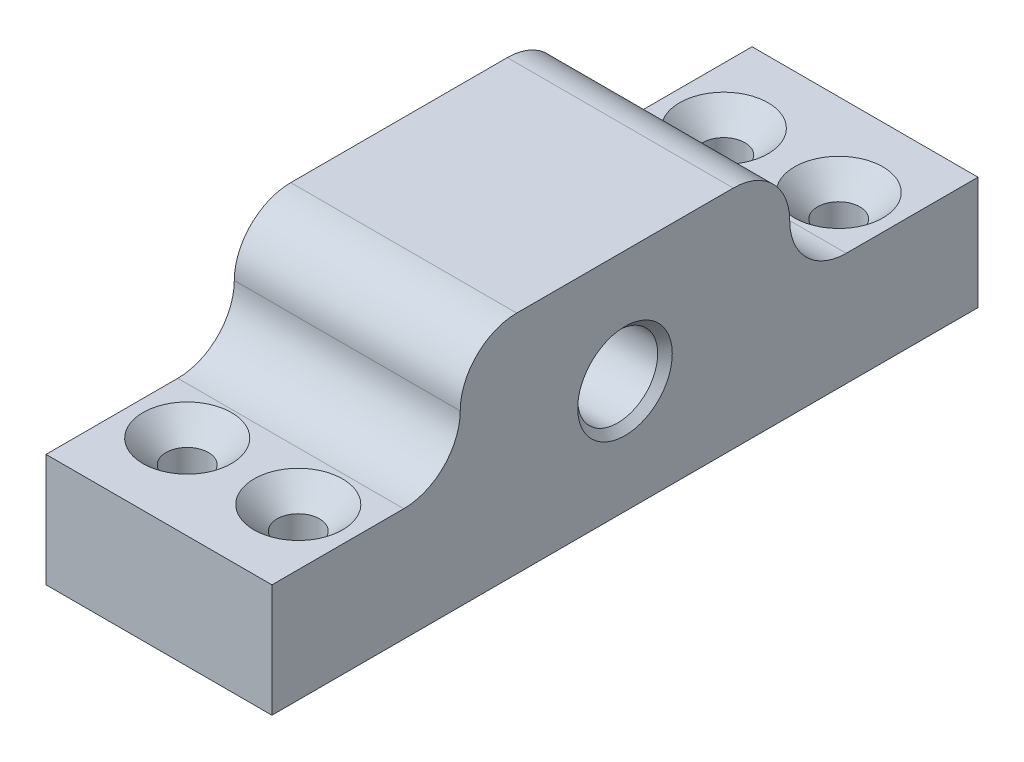
ISO-10303-21;
HEADER;
FILE_DESCRIPTION(('STEP AP214'),'2;1');
FILE_NAME('part.step','',(''),(''),'','','');
FILE_SCHEMA(('AUTOMOTIVE_DESIGN { 1 0 10303 214 1 1 1 1 }'));
ENDSEC;
DATA;
#1=APPLICATION_CONTEXT('core data for automotive mechanical design processes');
#2=APPLICATION_PROTOCOL_DEFINITION('international standard','automotive_design',2000,#1);
#3=PRODUCT_CONTEXT('',#1,'mechanical');
#4=PRODUCT('Part','Part','',(#3));
#5=PRODUCT_RELATED_PRODUCT_CATEGORY('part','',(#4));
#6=PRODUCT_DEFINITION_FORMATION('','',#4);
#7=PRODUCT_DEFINITION_CONTEXT('part definition',#1,'design');
#8=PRODUCT_DEFINITION('design','',#6,#7);
#9=PRODUCT_DEFINITION_SHAPE('','',#8);
#10=(LENGTH_UNIT() NAMED_UNIT(*) SI_UNIT(.MILLI.,.METRE.));
#11=(NAMED_UNIT(*) PLANE_ANGLE_UNIT() SI_UNIT($,.RADIAN.));
#12=(NAMED_UNIT(*) SI_UNIT($,.STERADIAN.) SOLID_ANGLE_UNIT());
#13=UNCERTAINTY_MEASURE_WITH_UNIT(LENGTH_MEASURE(1.E-05),#10,'distance_accuracy_value','');
#14=(GEOMETRIC_REPRESENTATION_CONTEXT(3) GLOBAL_UNCERTAINTY_ASSIGNED_CONTEXT((#13)) GLOBAL_UNIT_ASSIGNED_CONTEXT((#10,
#11,#12)) REPRESENTATION_CONTEXT('',''));
#15=CARTESIAN_POINT('',(0.,0.,0.));
#16=DIRECTION('',(0.,0.,1.));
#17=DIRECTION('',(1.,0.,0.));
#18=AXIS2_PLACEMENT_3D('',#15,#16,#17);
#19=CARTESIAN_POINT('',(24.,11.9999999999999,-37.4999999999996));
#20=DIRECTION('',(0.,0.,1.));
#21=DIRECTION('',(1.,0.,0.));
#22=AXIS2_PLACEMENT_3D('',#19,#20,#21);
#23=PLANE('',#22);
#24=DIRECTION('',(1.,0.,0.));
#25=VECTOR('',#24,1.);
#26=CARTESIAN_POINT('',(0.,-1.40512601554121E-13,-37.5000000000001));
#27=LINE('',#26,#25);
#28=CARTESIAN_POINT('',(0.,-1.40512601554121E-13,-37.5000000000001));
#29=VERTEX_POINT('',#28);
#30=CARTESIAN_POINT('',(24.,-1.40512601554121E-13,-37.5000000000001));
#31=VERTEX_POINT('',#30);
#32=EDGE_CURVE('E122',#29,#31,#27,.T.);
#33=ORIENTED_EDGE('',*,*,#32,.T.);
#34=DIRECTION('',(0.,1.,0.));
#35=VECTOR('',#34,1.);
#36=CARTESIAN_POINT('',(24.,11.9999999999999,-37.4999999999996));
#37=LINE('',#36,#35);
#38=CARTESIAN_POINT('',(24.,-12.0000000000001,-37.4999999999996));
#39=VERTEX_POINT('',#38);
#40=EDGE_CURVE('E226',#39,#31,#37,.T.);
#41=ORIENTED_EDGE('',*,*,#40,.F.);
#42=DIRECTION('',(-1.,0.,0.));
#43=VECTOR('',#42,1.);
#44=CARTESIAN_POINT('',(24.,-12.0000000000001,-37.4999999999996));
#45=LINE('',#44,#43);
#46=CARTESIAN_POINT('',(0.,-12.0000000000001,-37.4999999999996));
#47=VERTEX_POINT('',#46);
#48=EDGE_CURVE('E141',#39,#47,#45,.T.);
#49=ORIENTED_EDGE('',*,*,#48,.T.);
#50=DIRECTION('',(0.,1.,0.));
#51=VECTOR('',#50,1.);
#52=CARTESIAN_POINT('',(0.,11.9999999999999,-37.4999999999996));
#53=LINE('',#52,#51);
#54=EDGE_CURVE('E137',#47,#29,#53,.T.);
#55=ORIENTED_EDGE('',*,*,#54,.T.);
#56=EDGE_LOOP('',(#33,#41,#49,#55));
#57=FACE_BOUND('',#56,.T.);
#58=ADVANCED_FACE('F48',(#57),#23,.F.);
#59=CARTESIAN_POINT('',(24.,11.9999999999999,-37.4999999999996));
#60=DIRECTION('',(0.,-1.,0.));
#61=DIRECTION('',(0.,0.,-1.));
#62=AXIS2_PLACEMENT_3D('',#59,#60,#61);
#63=PLANE('',#62);
#64=DIRECTION('',(0.,0.,1.));
#65=VECTOR('',#64,1.);
#66=CARTESIAN_POINT('',(24.,11.9999999999999,-37.4999999999996));
#67=LINE('',#66,#65);
#68=CARTESIAN_POINT('',(24.,11.9999999999999,-11.5000000000001));
#69=VERTEX_POINT('',#68);
#70=CARTESIAN_POINT('',(24.,11.9999999999999,11.5000000000001));
#71=VERTEX_POINT('',#70);
#72=EDGE_CURVE('E153',#69,#71,#67,.T.);
#73=ORIENTED_EDGE('',*,*,#72,.F.);
#74=DIRECTION('',(1.,0.,0.));
#75=VECTOR('',#74,1.);
#76=CARTESIAN_POINT('',(0.,11.9999999999999,-11.5000000000001));
#77=LINE('',#76,#75);
#78=CARTESIAN_POINT('',(0.,11.9999999999999,-11.5000000000001));
#79=VERTEX_POINT('',#78);
#80=EDGE_CURVE('E177',#69,#79,#77,.F.);
#81=ORIENTED_EDGE('',*,*,#80,.T.);
#82=DIRECTION('',(0.,0.,1.));
#83=VECTOR('',#82,1.);
#84=CARTESIAN_POINT('',(0.,11.9999999999999,-37.4999999999996));
#85=LINE('',#84,#83);
#86=CARTESIAN_POINT('',(0.,11.9999999999999,11.5000000000001));
#87=VERTEX_POINT('',#86);
#88=EDGE_CURVE('E142',#79,#87,#85,.T.);
#89=ORIENTED_EDGE('',*,*,#88,.T.);
#90=DIRECTION('',(1.,0.,0.));
#91=VECTOR('',#90,1.);
#92=CARTESIAN_POINT('',(24.,11.9999999999999,11.5000000000001));
#93=LINE('',#92,#91);
#94=EDGE_CURVE('E156',#87,#71,#93,.T.);
#95=ORIENTED_EDGE('',*,*,#94,.T.);
#96=EDGE_LOOP('',(#73,#81,#89,#95));
#97=FACE_BOUND('',#96,.T.);
#98=ADVANCED_FACE('F196',(#97),#63,.F.);
#99=CARTESIAN_POINT('',(24.,0.,0.));
#100=DIRECTION('',(-1.,0.,0.));
#101=DIRECTION('',(0.,0.,1.));
#102=AXIS2_PLACEMENT_3D('',#99,#100,#101);
#103=PLANE('',#102);
#104=CARTESIAN_POINT('',(24.,0.,0.));
#105=DIRECTION('',(1.,0.,0.));
#106=DIRECTION('',(0.,0.,-1.));
#107=AXIS2_PLACEMENT_3D('',#104,#105,#106);
#108=CIRCLE('',#107,5.025);
#109=CARTESIAN_POINT('',(24.,0.,-5.025));
#110=VERTEX_POINT('',#109);
#111=EDGE_CURVE('E310',#110,#110,#108,.T.);
#112=ORIENTED_EDGE('',*,*,#111,.F.);
#113=EDGE_LOOP('',(#112));
#114=FACE_BOUND('',#113,.T.);
#115=DIRECTION('',(0.,0.,1.));
#116=VECTOR('',#115,1.);
#117=CARTESIAN_POINT('',(24.,-1.40512601554121E-13,-37.5000000000001));
#118=LINE('',#117,#116);
#119=CARTESIAN_POINT('',(24.,0.,-23.5));
#120=VERTEX_POINT('',#119);
#121=EDGE_CURVE('E127',#31,#120,#118,.T.);
#122=ORIENTED_EDGE('',*,*,#121,.T.);
#123=CARTESIAN_POINT('',(24.,5.99999999999996,-23.5000000000001));
#124=DIRECTION('',(-1.,0.,0.));
#125=DIRECTION('',(0.,0.,1.));
#126=AXIS2_PLACEMENT_3D('',#123,#124,#125);
#127=CIRCLE('',#126,6.);
#128=CARTESIAN_POINT('',(24.,5.99999999999987,-17.5000000000001));
#129=VERTEX_POINT('',#128);
#130=EDGE_CURVE('E57',#120,#129,#127,.T.);
#131=ORIENTED_EDGE('',*,*,#130,.T.);
#132=CARTESIAN_POINT('',(24.,5.99999999999987,-11.5000000000001));
#133=DIRECTION('',(-1.,0.,0.));
#134=DIRECTION('',(0.,0.,1.));
#135=AXIS2_PLACEMENT_3D('',#132,#133,#134);
#136=CIRCLE('',#135,6.);
#137=EDGE_CURVE('E170',#129,#69,#136,.F.);
#138=ORIENTED_EDGE('',*,*,#137,.T.);
#139=ORIENTED_EDGE('',*,*,#72,.T.);
#140=CARTESIAN_POINT('',(24.,5.99999999999986,11.5000000000001));
#141=DIRECTION('',(-1.,0.,0.));
#142=DIRECTION('',(0.,0.,1.));
#143=AXIS2_PLACEMENT_3D('',#140,#141,#142);
#144=CIRCLE('',#143,6.);
#145=CARTESIAN_POINT('',(24.,5.99999999999986,17.5000000000001));
#146=VERTEX_POINT('',#145);
#147=EDGE_CURVE('E159',#71,#146,#144,.F.);
#148=ORIENTED_EDGE('',*,*,#147,.T.);
#149=CARTESIAN_POINT('',(24.,5.99999999999996,23.5000000000001));
#150=DIRECTION('',(-1.,0.,0.));
#151=DIRECTION('',(0.,0.,1.));
#152=AXIS2_PLACEMENT_3D('',#149,#150,#151);
#153=CIRCLE('',#152,6.);
#154=CARTESIAN_POINT('',(24.,0.,23.5));
#155=VERTEX_POINT('',#154);
#156=EDGE_CURVE('E166',#146,#155,#153,.T.);
#157=ORIENTED_EDGE('',*,*,#156,.T.);
#158=DIRECTION('',(0.,0.,-1.));
#159=VECTOR('',#158,1.);
#160=CARTESIAN_POINT('',(24.,-1.40512601554121E-13,37.5000000000001));
#161=LINE('',#160,#159);
#162=CARTESIAN_POINT('',(24.,-1.40512601554121E-13,37.5000000000001));
#163=VERTEX_POINT('',#162);
#164=EDGE_CURVE('E174',#163,#155,#161,.T.);
#165=ORIENTED_EDGE('',*,*,#164,.F.);
#166=DIRECTION('',(0.,-1.,0.));
#167=VECTOR('',#166,1.);
#168=CARTESIAN_POINT('',(24.,11.9999999999999,37.5000000000001));
#169=LINE('',#168,#167);
#170=CARTESIAN_POINT('',(24.,-12.0000000000001,37.5000000000001));
#171=VERTEX_POINT('',#170);
#172=EDGE_CURVE('E145',#163,#171,#169,.T.);
#173=ORIENTED_EDGE('',*,*,#172,.T.);
#174=DIRECTION('',(0.,0.,-1.));
#175=VECTOR('',#174,1.);
#176=CARTESIAN_POINT('',(24.,-12.0000000000001,-37.4999999999996));
#177=LINE('',#176,#175);
#178=EDGE_CURVE('E224',#171,#39,#177,.T.);
#179=ORIENTED_EDGE('',*,*,#178,.T.);
#180=ORIENTED_EDGE('',*,*,#40,.T.);
#181=EDGE_LOOP('',(#122,#131,#138,#139,#148,#157,#165,#173,#179,#180));
#182=FACE_BOUND('',#181,.T.);
#183=ADVANCED_FACE('F186',(#114,#182),#103,.F.);
#184=CARTESIAN_POINT('',(0.,0.,0.));
#185=DIRECTION('',(-1.,0.,0.));
#186=DIRECTION('',(0.,0.,1.));
#187=AXIS2_PLACEMENT_3D('',#184,#185,#186);
#188=PLANE('',#187);
#189=CARTESIAN_POINT('',(0.,0.,0.));
#190=DIRECTION('',(1.,0.,0.));
#191=DIRECTION('',(0.,0.,-1.));
#192=AXIS2_PLACEMENT_3D('',#189,#190,#191);
#193=CIRCLE('',#192,4.24999999999999);
#194=CARTESIAN_POINT('',(0.,0.,-4.24999999999999));
#195=VERTEX_POINT('',#194);
#196=EDGE_CURVE('E312',#195,#195,#193,.T.);
#197=ORIENTED_EDGE('',*,*,#196,.T.);
#198=EDGE_LOOP('',(#197));
#199=FACE_BOUND('',#198,.T.);
#200=ORIENTED_EDGE('',*,*,#88,.F.);
#201=CARTESIAN_POINT('',(0.,5.99999999999987,-11.5000000000001));
#202=DIRECTION('',(-1.,0.,0.));
#203=DIRECTION('',(0.,0.,1.));
#204=AXIS2_PLACEMENT_3D('',#201,#202,#203);
#205=CIRCLE('',#204,6.);
#206=CARTESIAN_POINT('',(0.,5.99999999999987,-17.5000000000001));
#207=VERTEX_POINT('',#206);
#208=EDGE_CURVE('E67',#79,#207,#205,.T.);
#209=ORIENTED_EDGE('',*,*,#208,.T.);
#210=CARTESIAN_POINT('',(0.,5.99999999999996,-23.5000000000001));
#211=DIRECTION('',(-1.,0.,0.));
#212=DIRECTION('',(0.,0.,1.));
#213=AXIS2_PLACEMENT_3D('',#210,#211,#212);
#214=CIRCLE('',#213,6.);
#215=CARTESIAN_POINT('',(0.,0.,-23.5));
#216=VERTEX_POINT('',#215);
#217=EDGE_CURVE('E13',#207,#216,#214,.F.);
#218=ORIENTED_EDGE('',*,*,#217,.T.);
#219=DIRECTION('',(0.,0.,1.));
#220=VECTOR('',#219,1.);
#221=CARTESIAN_POINT('',(0.,-1.40512601554121E-13,-37.5000000000001));
#222=LINE('',#221,#220);
#223=EDGE_CURVE('E124',#29,#216,#222,.T.);
#224=ORIENTED_EDGE('',*,*,#223,.F.);
#225=ORIENTED_EDGE('',*,*,#54,.F.);
#226=DIRECTION('',(0.,0.,-1.));
#227=VECTOR('',#226,1.);
#228=CARTESIAN_POINT('',(0.,-12.0000000000001,-37.4999999999996));
#229=LINE('',#228,#227);
#230=CARTESIAN_POINT('',(0.,-12.0000000000001,37.5000000000001));
#231=VERTEX_POINT('',#230);
#232=EDGE_CURVE('E143',#231,#47,#229,.T.);
#233=ORIENTED_EDGE('',*,*,#232,.F.);
#234=DIRECTION('',(0.,-1.,0.));
#235=VECTOR('',#234,1.);
#236=CARTESIAN_POINT('',(0.,11.9999999999999,37.5000000000001));
#237=LINE('',#236,#235);
#238=CARTESIAN_POINT('',(0.,-1.40512601554121E-13,37.5000000000001));
#239=VERTEX_POINT('',#238);
#240=EDGE_CURVE('E147',#239,#231,#237,.T.);
#241=ORIENTED_EDGE('',*,*,#240,.F.);
#242=DIRECTION('',(0.,0.,-1.));
#243=VECTOR('',#242,1.);
#244=CARTESIAN_POINT('',(0.,-1.40512601554121E-13,37.5000000000001));
#245=LINE('',#244,#243);
#246=CARTESIAN_POINT('',(0.,0.,23.5));
#247=VERTEX_POINT('',#246);
#248=EDGE_CURVE('E213',#239,#247,#245,.T.);
#249=ORIENTED_EDGE('',*,*,#248,.T.);
#250=CARTESIAN_POINT('',(0.,5.99999999999996,23.5000000000001));
#251=DIRECTION('',(-1.,0.,0.));
#252=DIRECTION('',(0.,0.,1.));
#253=AXIS2_PLACEMENT_3D('',#250,#251,#252);
#254=CIRCLE('',#253,6.);
#255=CARTESIAN_POINT('',(0.,5.99999999999986,17.5000000000001));
#256=VERTEX_POINT('',#255);
#257=EDGE_CURVE('E168',#247,#256,#254,.F.);
#258=ORIENTED_EDGE('',*,*,#257,.T.);
#259=CARTESIAN_POINT('',(0.,5.99999999999986,11.5000000000001));
#260=DIRECTION('',(-1.,0.,0.));
#261=DIRECTION('',(0.,0.,1.));
#262=AXIS2_PLACEMENT_3D('',#259,#260,#261);
#263=CIRCLE('',#262,6.);
#264=EDGE_CURVE('E161',#256,#87,#263,.T.);
#265=ORIENTED_EDGE('',*,*,#264,.T.);
#266=EDGE_LOOP('',(#200,#209,#218,#224,#225,#233,#241,#249,#258,#265));
#267=FACE_BOUND('',#266,.T.);
#268=ADVANCED_FACE('F135',(#199,#267),#188,.T.);
#269=CARTESIAN_POINT('',(24.,11.9999999999999,37.5000000000001));
#270=DIRECTION('',(0.,0.,-1.));
#271=DIRECTION('',(-1.,0.,0.));
#272=AXIS2_PLACEMENT_3D('',#269,#270,#271);
#273=PLANE('',#272);
#274=ORIENTED_EDGE('',*,*,#172,.F.);
#275=DIRECTION('',(1.,0.,0.));
#276=VECTOR('',#275,1.);
#277=CARTESIAN_POINT('',(0.,-1.40512601554121E-13,37.5000000000001));
#278=LINE('',#277,#276);
#279=EDGE_CURVE('E216',#239,#163,#278,.T.);
#280=ORIENTED_EDGE('',*,*,#279,.F.);
#281=ORIENTED_EDGE('',*,*,#240,.T.);
#282=DIRECTION('',(-1.,0.,0.));
#283=VECTOR('',#282,1.);
#284=CARTESIAN_POINT('',(24.,-12.0000000000001,37.5000000000001));
#285=LINE('',#284,#283);
#286=EDGE_CURVE('E152',#171,#231,#285,.T.);
#287=ORIENTED_EDGE('',*,*,#286,.F.);
#288=EDGE_LOOP('',(#274,#280,#281,#287));
#289=FACE_BOUND('',#288,.T.);
#290=ADVANCED_FACE('F231',(#289),#273,.F.);
#291=CARTESIAN_POINT('',(24.,-12.0000000000001,-37.4999999999996));
#292=DIRECTION('',(0.,1.,0.));
#293=DIRECTION('',(0.,0.,1.));
#294=AXIS2_PLACEMENT_3D('',#291,#292,#293);
#295=PLANE('',#294);
#296=CARTESIAN_POINT('',(6.,-12.0000000000006,-28.5));
#297=DIRECTION('',(0.,1.,0.));
#298=DIRECTION('',(0.,0.,1.));
#299=AXIS2_PLACEMENT_3D('',#296,#297,#298);
#300=CIRCLE('',#299,2.25);
#301=CARTESIAN_POINT('',(6.,-12.0000000000006,-26.25));
#302=VERTEX_POINT('',#301);
#303=EDGE_CURVE('E323',#302,#302,#300,.T.);
#304=ORIENTED_EDGE('',*,*,#303,.T.);
#305=EDGE_LOOP('',(#304));
#306=FACE_BOUND('',#305,.T.);
#307=CARTESIAN_POINT('',(18.,-12.0000000000006,-28.7024893433951));
#308=DIRECTION('',(0.,1.,0.));
#309=DIRECTION('',(0.,0.,1.));
#310=AXIS2_PLACEMENT_3D('',#307,#308,#309);
#311=CIRCLE('',#310,2.25);
#312=CARTESIAN_POINT('',(18.,-12.0000000000006,-26.4524893433951));
#313=VERTEX_POINT('',#312);
#314=EDGE_CURVE('E192',#313,#313,#311,.T.);
#315=ORIENTED_EDGE('',*,*,#314,.T.);
#316=EDGE_LOOP('',(#315));
#317=FACE_BOUND('',#316,.T.);
#318=CARTESIAN_POINT('',(6.,-12.0000000000006,28.5));
#319=DIRECTION('',(0.,1.,0.));
#320=DIRECTION('',(0.,0.,1.));
#321=AXIS2_PLACEMENT_3D('',#318,#319,#320);
#322=CIRCLE('',#321,2.25);
#323=CARTESIAN_POINT('',(6.,-12.0000000000006,30.75));
#324=VERTEX_POINT('',#323);
#325=EDGE_CURVE('E339',#324,#324,#322,.T.);
#326=ORIENTED_EDGE('',*,*,#325,.T.);
#327=EDGE_LOOP('',(#326));
#328=FACE_BOUND('',#327,.T.);
#329=CARTESIAN_POINT('',(18.,-12.0000000000006,28.7024893433951));
#330=DIRECTION('',(0.,1.,0.));
#331=DIRECTION('',(0.,0.,1.));
#332=AXIS2_PLACEMENT_3D('',#329,#330,#331);
#333=CIRCLE('',#332,2.25);
#334=CARTESIAN_POINT('',(18.,-12.0000000000006,30.9524893433951));
#335=VERTEX_POINT('',#334);
#336=EDGE_CURVE('E175',#335,#335,#333,.T.);
#337=ORIENTED_EDGE('',*,*,#336,.T.);
#338=EDGE_LOOP('',(#337));
#339=FACE_BOUND('',#338,.T.);
#340=ORIENTED_EDGE('',*,*,#232,.T.);
#341=ORIENTED_EDGE('',*,*,#48,.F.);
#342=ORIENTED_EDGE('',*,*,#178,.F.);
#343=ORIENTED_EDGE('',*,*,#286,.T.);
#344=EDGE_LOOP('',(#340,#341,#342,#343));
#345=FACE_BOUND('',#344,.T.);
#346=ADVANCED_FACE('F234',(#306,#317,#328,#339,#345),#295,.F.);
#347=CARTESIAN_POINT('',(0.,-1.40512601554121E-13,37.5000000000001));
#348=DIRECTION('',(0.,-1.,0.));
#349=DIRECTION('',(0.,0.,-1.));
#350=AXIS2_PLACEMENT_3D('',#347,#348,#349);
#351=PLANE('',#350);
#352=CARTESIAN_POINT('',(6.,-2.00230457214624E-13,28.5000000000001));
#353=DIRECTION('',(0.,1.,0.));
#354=DIRECTION('',(0.,0.,1.));
#355=AXIS2_PLACEMENT_3D('',#352,#353,#354);
#356=CIRCLE('',#355,4.7);
#357=CARTESIAN_POINT('',(6.,-2.33250918579842E-13,33.2000000000001));
#358=VERTEX_POINT('',#357);
#359=EDGE_CURVE('E132',#358,#358,#356,.T.);
#360=ORIENTED_EDGE('',*,*,#359,.F.);
#361=EDGE_LOOP('',(#360));
#362=FACE_BOUND('',#361,.T.);
#363=CARTESIAN_POINT('',(18.,-2.01653072435995E-13,28.7024893433951));
#364=DIRECTION('',(0.,1.,0.));
#365=DIRECTION('',(0.,0.,1.));
#366=AXIS2_PLACEMENT_3D('',#363,#364,#365);
#367=CIRCLE('',#366,4.7);
#368=CARTESIAN_POINT('',(18.,-2.34673533801213E-13,33.4024893433951));
#369=VERTEX_POINT('',#368);
#370=EDGE_CURVE('E342',#369,#369,#367,.T.);
#371=ORIENTED_EDGE('',*,*,#370,.F.);
#372=EDGE_LOOP('',(#371));
#373=FACE_BOUND('',#372,.T.);
#374=ORIENTED_EDGE('',*,*,#164,.T.);
#375=DIRECTION('',(1.,0.,0.));
#376=VECTOR('',#375,1.);
#377=CARTESIAN_POINT('',(0.,0.,23.5));
#378=LINE('',#377,#376);
#379=EDGE_CURVE('E164',#155,#247,#378,.F.);
#380=ORIENTED_EDGE('',*,*,#379,.T.);
#381=ORIENTED_EDGE('',*,*,#248,.F.);
#382=ORIENTED_EDGE('',*,*,#279,.T.);
#383=EDGE_LOOP('',(#374,#380,#381,#382));
#384=FACE_BOUND('',#383,.T.);
#385=ADVANCED_FACE('F212',(#362,#373,#384),#351,.F.);
#386=CARTESIAN_POINT('',(0.,5.99999999999996,23.5000000000001));
#387=DIRECTION('',(-1.,0.,0.));
#388=DIRECTION('',(0.,0.,1.));
#389=AXIS2_PLACEMENT_3D('',#386,#387,#388);
#390=CYLINDRICAL_SURFACE('',#389,6.);
#391=DIRECTION('',(1.,0.,0.));
#392=VECTOR('',#391,1.);
#393=CARTESIAN_POINT('',(24.,5.99999999999996,17.5000000000001));
#394=LINE('',#393,#392);
#395=EDGE_CURVE('E171',#256,#146,#394,.T.);
#396=ORIENTED_EDGE('',*,*,#395,.F.);
#397=ORIENTED_EDGE('',*,*,#257,.F.);
#398=ORIENTED_EDGE('',*,*,#379,.F.);
#399=ORIENTED_EDGE('',*,*,#156,.F.);
#400=EDGE_LOOP('',(#396,#397,#398,#399));
#401=FACE_BOUND('',#400,.T.);
#402=ADVANCED_FACE('F210',(#401),#390,.F.);
#403=CARTESIAN_POINT('',(24.,5.99999999999986,11.5000000000001));
#404=DIRECTION('',(1.,0.,0.));
#405=DIRECTION('',(0.,0.,-1.));
#406=AXIS2_PLACEMENT_3D('',#403,#404,#405);
#407=CYLINDRICAL_SURFACE('',#406,6.);
#408=ORIENTED_EDGE('',*,*,#264,.F.);
#409=ORIENTED_EDGE('',*,*,#395,.T.);
#410=ORIENTED_EDGE('',*,*,#147,.F.);
#411=ORIENTED_EDGE('',*,*,#94,.F.);
#412=EDGE_LOOP('',(#408,#409,#410,#411));
#413=FACE_BOUND('',#412,.T.);
#414=ADVANCED_FACE('F204',(#413),#407,.T.);
#415=CARTESIAN_POINT('',(18.,-2.01653072435995E-13,28.7024893433951));
#416=DIRECTION('',(0.,1.,0.));
#417=DIRECTION('',(0.,0.,1.));
#418=AXIS2_PLACEMENT_3D('',#415,#416,#417);
#419=CYLINDRICAL_SURFACE('',#418,2.25);
#420=ORIENTED_EDGE('',*,*,#336,.F.);
#421=EDGE_LOOP('',(#420));
#422=FACE_BOUND('',#421,.T.);
#423=CARTESIAN_POINT('',(18.,-2.4500000000002,28.7024893433951));
#424=DIRECTION('',(0.,1.,0.));
#425=DIRECTION('',(0.,0.,1.));
#426=AXIS2_PLACEMENT_3D('',#423,#424,#425);
#427=CIRCLE('',#426,2.25);
#428=CARTESIAN_POINT('',(18.,-2.45000000000022,30.9524893433951));
#429=VERTEX_POINT('',#428);
#430=EDGE_CURVE('E344',#429,#429,#427,.T.);
#431=ORIENTED_EDGE('',*,*,#430,.T.);
#432=EDGE_LOOP('',(#431));
#433=FACE_BOUND('',#432,.T.);
#434=ADVANCED_FACE('F260',(#422,#433),#419,.F.);
#435=CARTESIAN_POINT('',(18.,-2.01653072435995E-13,28.7024893433951));
#436=DIRECTION('',(0.,1.,0.));
#437=DIRECTION('',(0.,0.,1.));
#438=AXIS2_PLACEMENT_3D('',#435,#436,#437);
#439=CONICAL_SURFACE('',#438,4.7,0.785398163397449);
#440=ORIENTED_EDGE('',*,*,#430,.F.);
#441=EDGE_LOOP('',(#440));
#442=FACE_BOUND('',#441,.T.);
#443=ORIENTED_EDGE('',*,*,#370,.T.);
#444=EDGE_LOOP('',(#443));
#445=FACE_BOUND('',#444,.T.);
#446=ADVANCED_FACE('F263',(#442,#445),#439,.F.);
#447=CARTESIAN_POINT('',(6.,-2.00230457214624E-13,28.5000000000001));
#448=DIRECTION('',(0.,1.,0.));
#449=DIRECTION('',(0.,0.,1.));
#450=AXIS2_PLACEMENT_3D('',#447,#448,#449);
#451=CYLINDRICAL_SURFACE('',#450,2.25);
#452=ORIENTED_EDGE('',*,*,#325,.F.);
#453=EDGE_LOOP('',(#452));
#454=FACE_BOUND('',#453,.T.);
#455=CARTESIAN_POINT('',(6.,-2.4500000000002,28.5000000000001));
#456=DIRECTION('',(0.,1.,0.));
#457=DIRECTION('',(0.,0.,1.));
#458=AXIS2_PLACEMENT_3D('',#455,#456,#457);
#459=CIRCLE('',#458,2.25);
#460=CARTESIAN_POINT('',(6.,-2.45000000000022,30.7500000000001));
#461=VERTEX_POINT('',#460);
#462=EDGE_CURVE('E336',#461,#461,#459,.T.);
#463=ORIENTED_EDGE('',*,*,#462,.T.);
#464=EDGE_LOOP('',(#463));
#465=FACE_BOUND('',#464,.T.);
#466=ADVANCED_FACE('F267',(#454,#465),#451,.F.);
#467=CARTESIAN_POINT('',(6.,-2.00230457214624E-13,28.5000000000001));
#468=DIRECTION('',(0.,1.,0.));
#469=DIRECTION('',(0.,0.,1.));
#470=AXIS2_PLACEMENT_3D('',#467,#468,#469);
#471=CONICAL_SURFACE('',#470,4.7,0.785398163397449);
#472=ORIENTED_EDGE('',*,*,#462,.F.);
#473=EDGE_LOOP('',(#472));
#474=FACE_BOUND('',#473,.T.);
#475=ORIENTED_EDGE('',*,*,#359,.T.);
#476=EDGE_LOOP('',(#475));
#477=FACE_BOUND('',#476,.T.);
#478=ADVANCED_FACE('F271',(#474,#477),#471,.F.);
#479=CARTESIAN_POINT('',(0.,-1.40512601554121E-13,-37.5000000000001));
#480=DIRECTION('',(0.,1.,0.));
#481=DIRECTION('',(0.,0.,1.));
#482=AXIS2_PLACEMENT_3D('',#479,#480,#481);
#483=PLANE('',#482);
#484=CARTESIAN_POINT('',(6.,-2.00230457214624E-13,-28.5000000000001));
#485=DIRECTION('',(0.,1.,0.));
#486=DIRECTION('',(0.,0.,1.));
#487=AXIS2_PLACEMENT_3D('',#484,#485,#486);
#488=CIRCLE('',#487,4.7);
#489=CARTESIAN_POINT('',(6.,-1.67209995849405E-13,-23.8000000000001));
#490=VERTEX_POINT('',#489);
#491=EDGE_CURVE('E317',#490,#490,#488,.T.);
#492=ORIENTED_EDGE('',*,*,#491,.F.);
#493=EDGE_LOOP('',(#492));
#494=FACE_BOUND('',#493,.T.);
#495=CARTESIAN_POINT('',(18.,-2.01653072435995E-13,-28.7024893433951));
#496=DIRECTION('',(0.,1.,0.));
#497=DIRECTION('',(0.,0.,1.));
#498=AXIS2_PLACEMENT_3D('',#495,#496,#497);
#499=CIRCLE('',#498,4.7);
#500=CARTESIAN_POINT('',(18.,-1.68632611070776E-13,-24.0024893433951));
#501=VERTEX_POINT('',#500);
#502=EDGE_CURVE('E325',#501,#501,#499,.T.);
#503=ORIENTED_EDGE('',*,*,#502,.F.);
#504=EDGE_LOOP('',(#503));
#505=FACE_BOUND('',#504,.T.);
#506=ORIENTED_EDGE('',*,*,#223,.T.);
#507=DIRECTION('',(1.,0.,0.));
#508=VECTOR('',#507,1.);
#509=CARTESIAN_POINT('',(24.,0.,-23.5));
#510=LINE('',#509,#508);
#511=EDGE_CURVE('E181',#216,#120,#510,.T.);
#512=ORIENTED_EDGE('',*,*,#511,.T.);
#513=ORIENTED_EDGE('',*,*,#121,.F.);
#514=ORIENTED_EDGE('',*,*,#32,.F.);
#515=EDGE_LOOP('',(#506,#512,#513,#514));
#516=FACE_BOUND('',#515,.T.);
#517=ADVANCED_FACE('F123',(#494,#505,#516),#483,.T.);
#518=CARTESIAN_POINT('',(0.,5.99999999999996,-23.5000000000001));
#519=DIRECTION('',(-1.,0.,0.));
#520=DIRECTION('',(0.,0.,1.));
#521=AXIS2_PLACEMENT_3D('',#518,#519,#520);
#522=CYLINDRICAL_SURFACE('',#521,6.);
#523=ORIENTED_EDGE('',*,*,#511,.F.);
#524=ORIENTED_EDGE('',*,*,#217,.F.);
#525=DIRECTION('',(1.,0.,0.));
#526=VECTOR('',#525,1.);
#527=CARTESIAN_POINT('',(0.,5.99999999999996,-17.5000000000001));
#528=LINE('',#527,#526);
#529=EDGE_CURVE('E52',#129,#207,#528,.F.);
#530=ORIENTED_EDGE('',*,*,#529,.F.);
#531=ORIENTED_EDGE('',*,*,#130,.F.);
#532=EDGE_LOOP('',(#523,#524,#530,#531));
#533=FACE_BOUND('',#532,.T.);
#534=ADVANCED_FACE('F50',(#533),#522,.F.);
#535=CARTESIAN_POINT('',(0.,5.99999999999987,-11.5000000000001));
#536=DIRECTION('',(-1.,0.,0.));
#537=DIRECTION('',(0.,0.,1.));
#538=AXIS2_PLACEMENT_3D('',#535,#536,#537);
#539=CYLINDRICAL_SURFACE('',#538,6.);
#540=ORIENTED_EDGE('',*,*,#208,.F.);
#541=ORIENTED_EDGE('',*,*,#80,.F.);
#542=ORIENTED_EDGE('',*,*,#137,.F.);
#543=ORIENTED_EDGE('',*,*,#529,.T.);
#544=EDGE_LOOP('',(#540,#541,#542,#543));
#545=FACE_BOUND('',#544,.T.);
#546=ADVANCED_FACE('F194',(#545),#539,.T.);
#547=CARTESIAN_POINT('',(18.,-2.01653072435995E-13,-28.7024893433951));
#548=DIRECTION('',(0.,1.,0.));
#549=DIRECTION('',(0.,0.,1.));
#550=AXIS2_PLACEMENT_3D('',#547,#548,#549);
#551=CYLINDRICAL_SURFACE('',#550,2.25);
#552=ORIENTED_EDGE('',*,*,#314,.F.);
#553=EDGE_LOOP('',(#552));
#554=FACE_BOUND('',#553,.T.);
#555=CARTESIAN_POINT('',(18.,-2.4500000000002,-28.7024893433951));
#556=DIRECTION('',(0.,1.,0.));
#557=DIRECTION('',(0.,0.,1.));
#558=AXIS2_PLACEMENT_3D('',#555,#556,#557);
#559=CIRCLE('',#558,2.25);
#560=CARTESIAN_POINT('',(18.,-2.45000000000018,-26.4524893433951));
#561=VERTEX_POINT('',#560);
#562=EDGE_CURVE('E328',#561,#561,#559,.T.);
#563=ORIENTED_EDGE('',*,*,#562,.T.);
#564=EDGE_LOOP('',(#563));
#565=FACE_BOUND('',#564,.T.);
#566=ADVANCED_FACE('F279',(#554,#565),#551,.F.);
#567=CARTESIAN_POINT('',(18.,-2.01653072435995E-13,-28.7024893433951));
#568=DIRECTION('',(0.,1.,0.));
#569=DIRECTION('',(0.,0.,1.));
#570=AXIS2_PLACEMENT_3D('',#567,#568,#569);
#571=CONICAL_SURFACE('',#570,4.7,0.785398163397449);
#572=ORIENTED_EDGE('',*,*,#562,.F.);
#573=EDGE_LOOP('',(#572));
#574=FACE_BOUND('',#573,.T.);
#575=ORIENTED_EDGE('',*,*,#502,.T.);
#576=EDGE_LOOP('',(#575));
#577=FACE_BOUND('',#576,.T.);
#578=ADVANCED_FACE('F282',(#574,#577),#571,.F.);
#579=CARTESIAN_POINT('',(6.,-2.00230457214624E-13,-28.5000000000001));
#580=DIRECTION('',(0.,1.,0.));
#581=DIRECTION('',(0.,0.,1.));
#582=AXIS2_PLACEMENT_3D('',#579,#580,#581);
#583=CYLINDRICAL_SURFACE('',#582,2.25);
#584=ORIENTED_EDGE('',*,*,#303,.F.);
#585=EDGE_LOOP('',(#584));
#586=FACE_BOUND('',#585,.T.);
#587=CARTESIAN_POINT('',(6.,-2.4500000000002,-28.5000000000001));
#588=DIRECTION('',(0.,1.,0.));
#589=DIRECTION('',(0.,0.,1.));
#590=AXIS2_PLACEMENT_3D('',#587,#588,#589);
#591=CIRCLE('',#590,2.25);
#592=CARTESIAN_POINT('',(6.,-2.45000000000018,-26.2500000000001));
#593=VERTEX_POINT('',#592);
#594=EDGE_CURVE('E320',#593,#593,#591,.T.);
#595=ORIENTED_EDGE('',*,*,#594,.T.);
#596=EDGE_LOOP('',(#595));
#597=FACE_BOUND('',#596,.T.);
#598=ADVANCED_FACE('F286',(#586,#597),#583,.F.);
#599=CARTESIAN_POINT('',(6.,-2.00230457214624E-13,-28.5000000000001));
#600=DIRECTION('',(0.,1.,0.));
#601=DIRECTION('',(0.,0.,1.));
#602=AXIS2_PLACEMENT_3D('',#599,#600,#601);
#603=CONICAL_SURFACE('',#602,4.7,0.785398163397449);
#604=ORIENTED_EDGE('',*,*,#594,.F.);
#605=EDGE_LOOP('',(#604));
#606=FACE_BOUND('',#605,.T.);
#607=ORIENTED_EDGE('',*,*,#491,.T.);
#608=EDGE_LOOP('',(#607));
#609=FACE_BOUND('',#608,.T.);
#610=ADVANCED_FACE('F290',(#606,#609),#603,.F.);
#611=CARTESIAN_POINT('',(24.,0.,0.));
#612=DIRECTION('',(1.,0.,0.));
#613=DIRECTION('',(0.,0.,-1.));
#614=AXIS2_PLACEMENT_3D('',#611,#612,#613);
#615=CYLINDRICAL_SURFACE('',#614,4.25);
#616=ORIENTED_EDGE('',*,*,#196,.F.);
#617=EDGE_LOOP('',(#616));
#618=FACE_BOUND('',#617,.T.);
#619=CARTESIAN_POINT('',(23.225,0.,0.));
#620=DIRECTION('',(1.,0.,0.));
#621=DIRECTION('',(0.,0.,-1.));
#622=AXIS2_PLACEMENT_3D('',#619,#620,#621);
#623=CIRCLE('',#622,4.25);
#624=CARTESIAN_POINT('',(23.225,0.,-4.25));
#625=VERTEX_POINT('',#624);
#626=EDGE_CURVE('E307',#625,#625,#623,.T.);
#627=ORIENTED_EDGE('',*,*,#626,.T.);
#628=EDGE_LOOP('',(#627));
#629=FACE_BOUND('',#628,.T.);
#630=ADVANCED_FACE('F294',(#618,#629),#615,.F.);
#631=CARTESIAN_POINT('',(24.,0.,0.));
#632=DIRECTION('',(1.,0.,0.));
#633=DIRECTION('',(0.,0.,-1.));
#634=AXIS2_PLACEMENT_3D('',#631,#632,#633);
#635=CONICAL_SURFACE('',#634,5.025,0.785398163397447);
#636=ORIENTED_EDGE('',*,*,#626,.F.);
#637=EDGE_LOOP('',(#636));
#638=FACE_BOUND('',#637,.T.);
#639=ORIENTED_EDGE('',*,*,#111,.T.);
#640=EDGE_LOOP('',(#639));
#641=FACE_BOUND('',#640,.T.);
#642=ADVANCED_FACE('F298',(#638,#641),#635,.F.);
#643=CLOSED_SHELL('',(#58,#98,#183,#268,#290,#346,#385,#402,#414,#434,#446,#466,#478,#517,#534,
#546,#566,#578,#598,#610,#630,#642));
#644=MANIFOLD_SOLID_BREP('B2',#643);
#645=ADVANCED_BREP_SHAPE_REPRESENTATION('',(#18,#644),#14);
#646=SHAPE_DEFINITION_REPRESENTATION(#9,#645);
ENDSEC;
END-ISO-10303-21;
